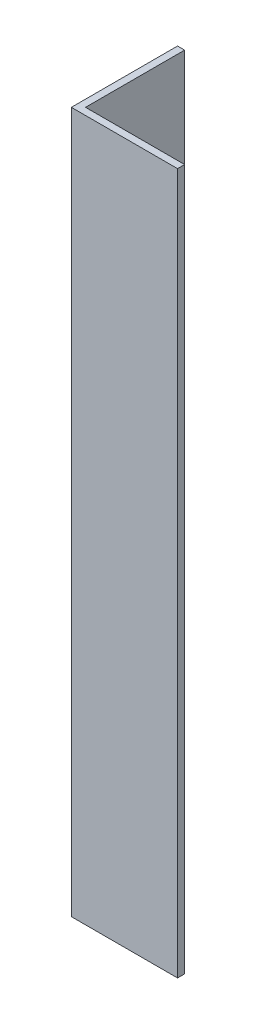
ISO-10303-21;
HEADER;
FILE_DESCRIPTION(('STEP AP214'),'2;1');
FILE_NAME('part.step','',(''),(''),'','','');
FILE_SCHEMA(('AUTOMOTIVE_DESIGN { 1 0 10303 214 1 1 1 1 }'));
ENDSEC;
DATA;
#1=APPLICATION_CONTEXT('core data for automotive mechanical design processes');
#2=APPLICATION_PROTOCOL_DEFINITION('international standard','automotive_design',2000,#1);
#3=PRODUCT_CONTEXT('',#1,'mechanical');
#4=PRODUCT('Part','Part','',(#3));
#5=PRODUCT_RELATED_PRODUCT_CATEGORY('part','',(#4));
#6=PRODUCT_DEFINITION_FORMATION('','',#4);
#7=PRODUCT_DEFINITION_CONTEXT('part definition',#1,'design');
#8=PRODUCT_DEFINITION('design','',#6,#7);
#9=PRODUCT_DEFINITION_SHAPE('','',#8);
#10=(LENGTH_UNIT() NAMED_UNIT(*) SI_UNIT(.MILLI.,.METRE.));
#11=(NAMED_UNIT(*) PLANE_ANGLE_UNIT() SI_UNIT($,.RADIAN.));
#12=(NAMED_UNIT(*) SI_UNIT($,.STERADIAN.) SOLID_ANGLE_UNIT());
#13=UNCERTAINTY_MEASURE_WITH_UNIT(LENGTH_MEASURE(1.E-05),#10,'distance_accuracy_value','');
#14=(GEOMETRIC_REPRESENTATION_CONTEXT(3) GLOBAL_UNCERTAINTY_ASSIGNED_CONTEXT((#13)) GLOBAL_UNIT_ASSIGNED_CONTEXT((#10,
#11,#12)) REPRESENTATION_CONTEXT('',''));
#15=CARTESIAN_POINT('',(0.,0.,0.));
#16=DIRECTION('',(0.,0.,1.));
#17=DIRECTION('',(1.,0.,0.));
#18=AXIS2_PLACEMENT_3D('',#15,#16,#17);
#19=CARTESIAN_POINT('',(15.,99.,0.));
#20=DIRECTION('',(0.,0.,-1.));
#21=DIRECTION('',(-1.,0.,0.));
#22=AXIS2_PLACEMENT_3D('',#19,#20,#21);
#23=PLANE('',#22);
#24=DIRECTION('',(1.,0.,0.));
#25=VECTOR('',#24,1.);
#26=CARTESIAN_POINT('',(15.,0.,0.));
#27=LINE('',#26,#25);
#28=CARTESIAN_POINT('',(0.,0.,0.));
#29=VERTEX_POINT('',#28);
#30=CARTESIAN_POINT('',(15.,0.,0.));
#31=VERTEX_POINT('',#30);
#32=EDGE_CURVE('E119',#29,#31,#27,.T.);
#33=ORIENTED_EDGE('',*,*,#32,.T.);
#34=DIRECTION('',(0.,-1.,0.));
#35=VECTOR('',#34,1.);
#36=CARTESIAN_POINT('',(15.,99.,0.));
#37=LINE('',#36,#35);
#38=CARTESIAN_POINT('',(15.,99.,0.));
#39=VERTEX_POINT('',#38);
#40=EDGE_CURVE('E11',#39,#31,#37,.T.);
#41=ORIENTED_EDGE('',*,*,#40,.F.);
#42=DIRECTION('',(1.,0.,0.));
#43=VECTOR('',#42,1.);
#44=CARTESIAN_POINT('',(15.,99.,0.));
#45=LINE('',#44,#43);
#46=CARTESIAN_POINT('',(0.,99.,0.));
#47=VERTEX_POINT('',#46);
#48=EDGE_CURVE('E129',#47,#39,#45,.T.);
#49=ORIENTED_EDGE('',*,*,#48,.F.);
#50=DIRECTION('',(0.,-1.,0.));
#51=VECTOR('',#50,1.);
#52=CARTESIAN_POINT('',(0.,99.,0.));
#53=LINE('',#52,#51);
#54=EDGE_CURVE('E115',#47,#29,#53,.T.);
#55=ORIENTED_EDGE('',*,*,#54,.T.);
#56=EDGE_LOOP('',(#33,#41,#49,#55));
#57=FACE_BOUND('',#56,.T.);
#58=ADVANCED_FACE('F35',(#57),#23,.F.);
#59=CARTESIAN_POINT('',(15.,99.,-0.999999999999998));
#60=DIRECTION('',(-1.,0.,0.));
#61=DIRECTION('',(0.,0.,1.));
#62=AXIS2_PLACEMENT_3D('',#59,#60,#61);
#63=PLANE('',#62);
#64=DIRECTION('',(0.,0.,-1.));
#65=VECTOR('',#64,1.);
#66=CARTESIAN_POINT('',(15.,0.,-0.999999999999998));
#67=LINE('',#66,#65);
#68=CARTESIAN_POINT('',(15.,0.,-0.999999999999998));
#69=VERTEX_POINT('',#68);
#70=EDGE_CURVE('E122',#31,#69,#67,.T.);
#71=ORIENTED_EDGE('',*,*,#70,.T.);
#72=DIRECTION('',(0.,-1.,0.));
#73=VECTOR('',#72,1.);
#74=CARTESIAN_POINT('',(15.,99.,-0.999999999999998));
#75=LINE('',#74,#73);
#76=CARTESIAN_POINT('',(15.,99.,-0.999999999999998));
#77=VERTEX_POINT('',#76);
#78=EDGE_CURVE('E43',#77,#69,#75,.T.);
#79=ORIENTED_EDGE('',*,*,#78,.F.);
#80=DIRECTION('',(0.,0.,-1.));
#81=VECTOR('',#80,1.);
#82=CARTESIAN_POINT('',(15.,99.,-0.999999999999998));
#83=LINE('',#82,#81);
#84=EDGE_CURVE('E88',#39,#77,#83,.T.);
#85=ORIENTED_EDGE('',*,*,#84,.F.);
#86=ORIENTED_EDGE('',*,*,#40,.T.);
#87=EDGE_LOOP('',(#71,#79,#85,#86));
#88=FACE_BOUND('',#87,.T.);
#89=ADVANCED_FACE('F153',(#88),#63,.F.);
#90=CARTESIAN_POINT('',(1.,99.,-0.999999999999997));
#91=DIRECTION('',(0.,0.,1.));
#92=DIRECTION('',(1.,0.,0.));
#93=AXIS2_PLACEMENT_3D('',#90,#91,#92);
#94=PLANE('',#93);
#95=DIRECTION('',(-1.,0.,0.));
#96=VECTOR('',#95,1.);
#97=CARTESIAN_POINT('',(1.,0.,-0.999999999999997));
#98=LINE('',#97,#96);
#99=CARTESIAN_POINT('',(1.,0.,-0.999999999999997));
#100=VERTEX_POINT('',#99);
#101=EDGE_CURVE('E124',#69,#100,#98,.T.);
#102=ORIENTED_EDGE('',*,*,#101,.T.);
#103=DIRECTION('',(0.,-1.,0.));
#104=VECTOR('',#103,1.);
#105=CARTESIAN_POINT('',(1.,99.,-0.999999999999997));
#106=LINE('',#105,#104);
#107=CARTESIAN_POINT('',(1.,99.,-0.999999999999997));
#108=VERTEX_POINT('',#107);
#109=EDGE_CURVE('E110',#108,#100,#106,.T.);
#110=ORIENTED_EDGE('',*,*,#109,.F.);
#111=DIRECTION('',(-1.,0.,0.));
#112=VECTOR('',#111,1.);
#113=CARTESIAN_POINT('',(1.,99.,-0.999999999999997));
#114=LINE('',#113,#112);
#115=EDGE_CURVE('E101',#77,#108,#114,.T.);
#116=ORIENTED_EDGE('',*,*,#115,.F.);
#117=ORIENTED_EDGE('',*,*,#78,.T.);
#118=EDGE_LOOP('',(#102,#110,#116,#117));
#119=FACE_BOUND('',#118,.T.);
#120=ADVANCED_FACE('F135',(#119),#94,.F.);
#121=CARTESIAN_POINT('',(0.999999999999998,99.,-15.));
#122=DIRECTION('',(-1.,0.,0.));
#123=DIRECTION('',(0.,0.,1.));
#124=AXIS2_PLACEMENT_3D('',#121,#122,#123);
#125=PLANE('',#124);
#126=DIRECTION('',(0.,0.,-1.));
#127=VECTOR('',#126,1.);
#128=CARTESIAN_POINT('',(0.999999999999998,0.,-15.));
#129=LINE('',#128,#127);
#130=CARTESIAN_POINT('',(0.999999999999998,0.,-15.));
#131=VERTEX_POINT('',#130);
#132=EDGE_CURVE('E109',#100,#131,#129,.T.);
#133=ORIENTED_EDGE('',*,*,#132,.T.);
#134=DIRECTION('',(0.,-1.,0.));
#135=VECTOR('',#134,1.);
#136=CARTESIAN_POINT('',(0.999999999999998,99.,-15.));
#137=LINE('',#136,#135);
#138=CARTESIAN_POINT('',(0.999999999999998,99.,-15.));
#139=VERTEX_POINT('',#138);
#140=EDGE_CURVE('E106',#139,#131,#137,.T.);
#141=ORIENTED_EDGE('',*,*,#140,.F.);
#142=DIRECTION('',(0.,0.,-1.));
#143=VECTOR('',#142,1.);
#144=CARTESIAN_POINT('',(0.999999999999998,99.,-15.));
#145=LINE('',#144,#143);
#146=EDGE_CURVE('E95',#108,#139,#145,.T.);
#147=ORIENTED_EDGE('',*,*,#146,.F.);
#148=ORIENTED_EDGE('',*,*,#109,.T.);
#149=EDGE_LOOP('',(#133,#141,#147,#148));
#150=FACE_BOUND('',#149,.T.);
#151=ADVANCED_FACE('F107',(#150),#125,.F.);
#152=CARTESIAN_POINT('',(0.,99.,-15.));
#153=DIRECTION('',(0.,0.,1.));
#154=DIRECTION('',(1.,0.,0.));
#155=AXIS2_PLACEMENT_3D('',#152,#153,#154);
#156=PLANE('',#155);
#157=DIRECTION('',(-1.,0.,0.));
#158=VECTOR('',#157,1.);
#159=CARTESIAN_POINT('',(0.,0.,-15.));
#160=LINE('',#159,#158);
#161=CARTESIAN_POINT('',(0.,0.,-15.));
#162=VERTEX_POINT('',#161);
#163=EDGE_CURVE('E74',#131,#162,#160,.T.);
#164=ORIENTED_EDGE('',*,*,#163,.T.);
#165=DIRECTION('',(0.,-1.,0.));
#166=VECTOR('',#165,1.);
#167=CARTESIAN_POINT('',(0.,99.,-15.));
#168=LINE('',#167,#166);
#169=CARTESIAN_POINT('',(0.,99.,-15.));
#170=VERTEX_POINT('',#169);
#171=EDGE_CURVE('E111',#170,#162,#168,.T.);
#172=ORIENTED_EDGE('',*,*,#171,.F.);
#173=DIRECTION('',(-1.,0.,0.));
#174=VECTOR('',#173,1.);
#175=CARTESIAN_POINT('',(0.,99.,-15.));
#176=LINE('',#175,#174);
#177=EDGE_CURVE('E99',#139,#170,#176,.T.);
#178=ORIENTED_EDGE('',*,*,#177,.F.);
#179=ORIENTED_EDGE('',*,*,#140,.T.);
#180=EDGE_LOOP('',(#164,#172,#178,#179));
#181=FACE_BOUND('',#180,.T.);
#182=ADVANCED_FACE('F113',(#181),#156,.F.);
#183=CARTESIAN_POINT('',(0.,99.,0.));
#184=DIRECTION('',(1.,0.,0.));
#185=DIRECTION('',(0.,0.,-1.));
#186=AXIS2_PLACEMENT_3D('',#183,#184,#185);
#187=PLANE('',#186);
#188=DIRECTION('',(0.,0.,1.));
#189=VECTOR('',#188,1.);
#190=CARTESIAN_POINT('',(0.,0.,0.));
#191=LINE('',#190,#189);
#192=EDGE_CURVE('E80',#162,#29,#191,.T.);
#193=ORIENTED_EDGE('',*,*,#192,.T.);
#194=ORIENTED_EDGE('',*,*,#54,.F.);
#195=DIRECTION('',(0.,0.,1.));
#196=VECTOR('',#195,1.);
#197=CARTESIAN_POINT('',(0.,99.,0.));
#198=LINE('',#197,#196);
#199=EDGE_CURVE('E51',#170,#47,#198,.T.);
#200=ORIENTED_EDGE('',*,*,#199,.F.);
#201=ORIENTED_EDGE('',*,*,#171,.T.);
#202=EDGE_LOOP('',(#193,#194,#200,#201));
#203=FACE_BOUND('',#202,.T.);
#204=ADVANCED_FACE('F142',(#203),#187,.F.);
#205=CARTESIAN_POINT('',(0.,99.,0.));
#206=DIRECTION('',(0.,-1.,0.));
#207=DIRECTION('',(0.,0.,-1.));
#208=AXIS2_PLACEMENT_3D('',#205,#206,#207);
#209=PLANE('',#208);
#210=ORIENTED_EDGE('',*,*,#48,.T.);
#211=ORIENTED_EDGE('',*,*,#84,.T.);
#212=ORIENTED_EDGE('',*,*,#115,.T.);
#213=ORIENTED_EDGE('',*,*,#146,.T.);
#214=ORIENTED_EDGE('',*,*,#177,.T.);
#215=ORIENTED_EDGE('',*,*,#199,.T.);
#216=EDGE_LOOP('',(#210,#211,#212,#213,#214,#215));
#217=FACE_BOUND('',#216,.T.);
#218=ADVANCED_FACE('F97',(#217),#209,.F.);
#219=CARTESIAN_POINT('',(0.,0.,0.));
#220=DIRECTION('',(0.,-1.,0.));
#221=DIRECTION('',(0.,0.,-1.));
#222=AXIS2_PLACEMENT_3D('',#219,#220,#221);
#223=PLANE('',#222);
#224=ORIENTED_EDGE('',*,*,#32,.F.);
#225=ORIENTED_EDGE('',*,*,#192,.F.);
#226=ORIENTED_EDGE('',*,*,#163,.F.);
#227=ORIENTED_EDGE('',*,*,#132,.F.);
#228=ORIENTED_EDGE('',*,*,#101,.F.);
#229=ORIENTED_EDGE('',*,*,#70,.F.);
#230=EDGE_LOOP('',(#224,#225,#226,#227,#228,#229));
#231=FACE_BOUND('',#230,.T.);
#232=ADVANCED_FACE('F138',(#231),#223,.T.);
#233=CLOSED_SHELL('',(#58,#89,#120,#151,#182,#204,#218,#232));
#234=MANIFOLD_SOLID_BREP('B2',#233);
#235=ADVANCED_BREP_SHAPE_REPRESENTATION('',(#18,#234),#14);
#236=SHAPE_DEFINITION_REPRESENTATION(#9,#235);
ENDSEC;
END-ISO-10303-21;
